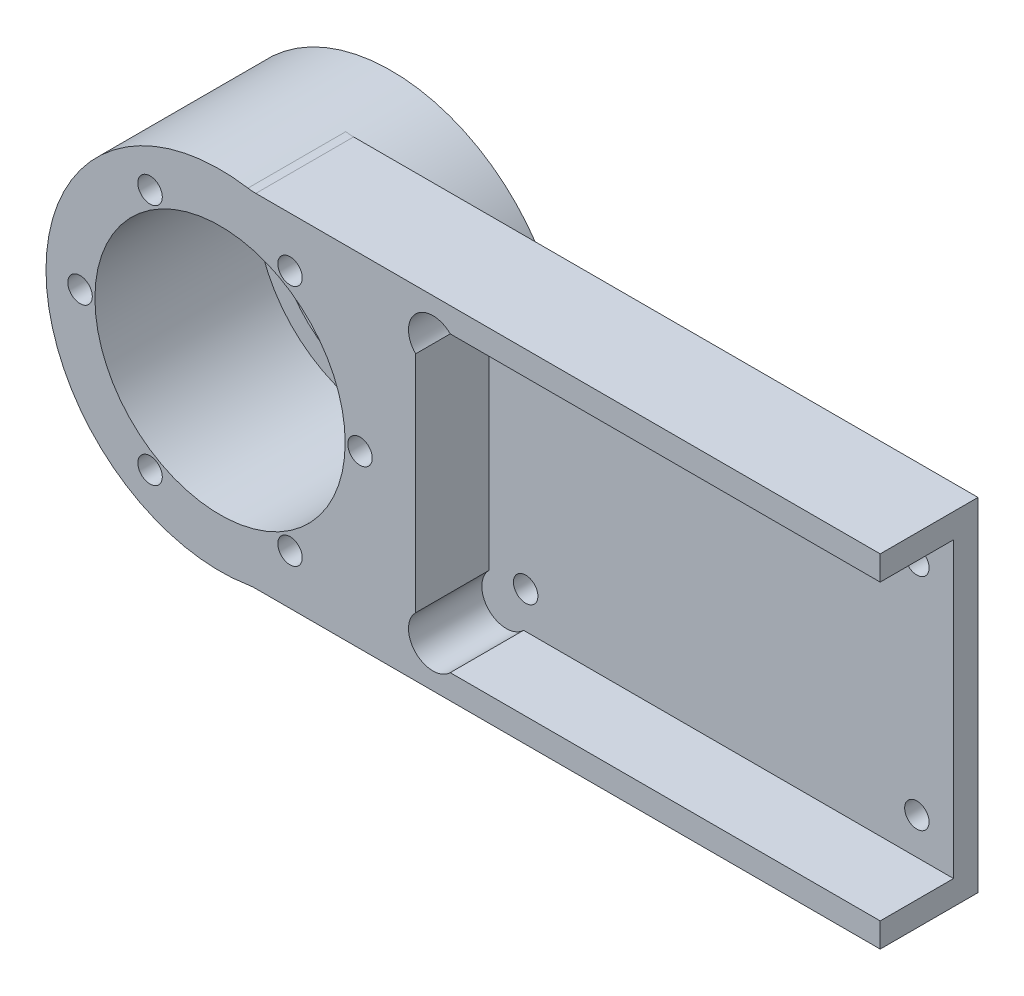
ISO-10303-21;
HEADER;
FILE_DESCRIPTION(('STEP AP214'),'2;1');
FILE_NAME('part.step','',(''),(''),'','','');
FILE_SCHEMA(('AUTOMOTIVE_DESIGN { 1 0 10303 214 1 1 1 1 }'));
ENDSEC;
DATA;
#1=APPLICATION_CONTEXT('core data for automotive mechanical design processes');
#2=APPLICATION_PROTOCOL_DEFINITION('international standard','automotive_design',2000,#1);
#3=PRODUCT_CONTEXT('',#1,'mechanical');
#4=PRODUCT('Part','Part','',(#3));
#5=PRODUCT_RELATED_PRODUCT_CATEGORY('part','',(#4));
#6=PRODUCT_DEFINITION_FORMATION('','',#4);
#7=PRODUCT_DEFINITION_CONTEXT('part definition',#1,'design');
#8=PRODUCT_DEFINITION('design','',#6,#7);
#9=PRODUCT_DEFINITION_SHAPE('','',#8);
#10=(LENGTH_UNIT() NAMED_UNIT(*) SI_UNIT(.MILLI.,.METRE.));
#11=(NAMED_UNIT(*) PLANE_ANGLE_UNIT() SI_UNIT($,.RADIAN.));
#12=(NAMED_UNIT(*) SI_UNIT($,.STERADIAN.) SOLID_ANGLE_UNIT());
#13=UNCERTAINTY_MEASURE_WITH_UNIT(LENGTH_MEASURE(1.E-05),#10,'distance_accuracy_value','');
#14=(GEOMETRIC_REPRESENTATION_CONTEXT(3) GLOBAL_UNCERTAINTY_ASSIGNED_CONTEXT((#13)) GLOBAL_UNIT_ASSIGNED_CONTEXT((#10,
#11,#12)) REPRESENTATION_CONTEXT('',''));
#15=CARTESIAN_POINT('',(0.,0.,0.));
#16=DIRECTION('',(0.,0.,1.));
#17=DIRECTION('',(1.,0.,0.));
#18=AXIS2_PLACEMENT_3D('',#15,#16,#17);
#19=CARTESIAN_POINT('',(0.,0.,6.35));
#20=DIRECTION('',(0.,0.,-1.));
#21=DIRECTION('',(-1.,0.,0.));
#22=AXIS2_PLACEMENT_3D('',#19,#20,#21);
#23=CYLINDRICAL_SURFACE('',#22,32.5);
#24=CARTESIAN_POINT('',(0.,0.,25.4));
#25=DIRECTION('',(0.,0.,1.));
#26=DIRECTION('',(1.,0.,0.));
#27=AXIS2_PLACEMENT_3D('',#24,#25,#26);
#28=CIRCLE('',#27,32.5);
#29=CARTESIAN_POINT('',(32.5,0.,25.4));
#30=VERTEX_POINT('',#29);
#31=EDGE_CURVE('E297',#30,#30,#28,.T.);
#32=ORIENTED_EDGE('',*,*,#31,.T.);
#33=EDGE_LOOP('',(#32));
#34=FACE_BOUND('',#33,.T.);
#35=CARTESIAN_POINT('',(0.,0.,-16.51));
#36=DIRECTION('',(0.,0.,-1.));
#37=DIRECTION('',(-1.,0.,0.));
#38=AXIS2_PLACEMENT_3D('',#35,#36,#37);
#39=CIRCLE('',#38,32.5);
#40=CARTESIAN_POINT('',(-32.5,0.,-16.51));
#41=VERTEX_POINT('',#40);
#42=EDGE_CURVE('E170',#41,#41,#39,.T.);
#43=ORIENTED_EDGE('',*,*,#42,.T.);
#44=EDGE_LOOP('',(#43));
#45=FACE_BOUND('',#44,.T.);
#46=ADVANCED_FACE('F72',(#34,#45),#23,.F.);
#47=CARTESIAN_POINT('',(0.,0.,0.));
#48=DIRECTION('',(0.,0.,1.));
#49=DIRECTION('',(1.,0.,0.));
#50=AXIS2_PLACEMENT_3D('',#47,#48,#49);
#51=PLANE('',#50);
#52=CARTESIAN_POINT('',(60.325,28.575,0.));
#53=DIRECTION('',(0.,0.,1.));
#54=DIRECTION('',(1.,0.,0.));
#55=AXIS2_PLACEMENT_3D('',#52,#53,#54);
#56=CIRCLE('',#55,3.175);
#57=CARTESIAN_POINT('',(63.5,28.575,0.));
#58=VERTEX_POINT('',#57);
#59=EDGE_CURVE('E270',#58,#58,#56,.T.);
#60=ORIENTED_EDGE('',*,*,#59,.T.);
#61=EDGE_LOOP('',(#60));
#62=FACE_BOUND('',#61,.T.);
#63=CARTESIAN_POINT('',(161.925,28.575,0.));
#64=DIRECTION('',(0.,0.,1.));
#65=DIRECTION('',(1.,0.,0.));
#66=AXIS2_PLACEMENT_3D('',#63,#64,#65);
#67=CIRCLE('',#66,3.175);
#68=CARTESIAN_POINT('',(165.1,28.575,0.));
#69=VERTEX_POINT('',#68);
#70=EDGE_CURVE('E266',#69,#69,#67,.T.);
#71=ORIENTED_EDGE('',*,*,#70,.T.);
#72=EDGE_LOOP('',(#71));
#73=FACE_BOUND('',#72,.T.);
#74=CARTESIAN_POINT('',(161.925,-28.575,0.));
#75=DIRECTION('',(0.,0.,1.));
#76=DIRECTION('',(1.,0.,0.));
#77=AXIS2_PLACEMENT_3D('',#74,#75,#76);
#78=CIRCLE('',#77,3.175);
#79=CARTESIAN_POINT('',(165.1,-28.575,0.));
#80=VERTEX_POINT('',#79);
#81=EDGE_CURVE('E271',#80,#80,#78,.T.);
#82=ORIENTED_EDGE('',*,*,#81,.T.);
#83=EDGE_LOOP('',(#82));
#84=FACE_BOUND('',#83,.T.);
#85=CARTESIAN_POINT('',(60.325,-28.575,0.));
#86=DIRECTION('',(0.,0.,1.));
#87=DIRECTION('',(1.,0.,0.));
#88=AXIS2_PLACEMENT_3D('',#85,#86,#87);
#89=CIRCLE('',#88,3.175);
#90=CARTESIAN_POINT('',(63.5,-28.575,0.));
#91=VERTEX_POINT('',#90);
#92=EDGE_CURVE('E265',#91,#91,#89,.T.);
#93=ORIENTED_EDGE('',*,*,#92,.T.);
#94=EDGE_LOOP('',(#93));
#95=FACE_BOUND('',#94,.T.);
#96=CARTESIAN_POINT('',(0.,0.,0.));
#97=DIRECTION('',(0.,0.,-1.));
#98=DIRECTION('',(-1.,0.,0.));
#99=AXIS2_PLACEMENT_3D('',#96,#97,#98);
#100=CIRCLE('',#99,45.2);
#101=CARTESIAN_POINT('',(7.25159956563402,44.6145077720207,0.));
#102=VERTEX_POINT('',#101);
#103=CARTESIAN_POINT('',(7.25159956563402,-44.6145077720207,0.));
#104=VERTEX_POINT('',#103);
#105=EDGE_CURVE('E161',#102,#104,#100,.T.);
#106=ORIENTED_EDGE('',*,*,#105,.F.);
#107=CARTESIAN_POINT('',(9.28910652323473,57.15,0.));
#108=DIRECTION('',(0.,0.,1.));
#109=DIRECTION('',(1.,0.,0.));
#110=AXIS2_PLACEMENT_3D('',#107,#108,#109);
#111=CIRCLE('',#110,12.7);
#112=CARTESIAN_POINT('',(9.28910652323473,44.45,0.));
#113=VERTEX_POINT('',#112);
#114=EDGE_CURVE('E82',#102,#113,#111,.T.);
#115=ORIENTED_EDGE('',*,*,#114,.T.);
#116=DIRECTION('',(1.,0.,0.));
#117=VECTOR('',#116,1.);
#118=CARTESIAN_POINT('',(0.,44.45,0.));
#119=LINE('',#118,#117);
#120=CARTESIAN_POINT('',(171.45,44.45,0.));
#121=VERTEX_POINT('',#120);
#122=EDGE_CURVE('E358',#113,#121,#119,.T.);
#123=ORIENTED_EDGE('',*,*,#122,.T.);
#124=DIRECTION('',(0.,1.,0.));
#125=VECTOR('',#124,1.);
#126=CARTESIAN_POINT('',(171.45,7.4940054162198E-13,0.));
#127=LINE('',#126,#125);
#128=CARTESIAN_POINT('',(171.45,-44.45,0.));
#129=VERTEX_POINT('',#128);
#130=EDGE_CURVE('E348',#129,#121,#127,.T.);
#131=ORIENTED_EDGE('',*,*,#130,.F.);
#132=DIRECTION('',(1.,0.,0.));
#133=VECTOR('',#132,1.);
#134=CARTESIAN_POINT('',(0.,-44.45,0.));
#135=LINE('',#134,#133);
#136=CARTESIAN_POINT('',(9.28910652323473,-44.45,0.));
#137=VERTEX_POINT('',#136);
#138=EDGE_CURVE('E354',#137,#129,#135,.T.);
#139=ORIENTED_EDGE('',*,*,#138,.F.);
#140=CARTESIAN_POINT('',(9.28910652323473,-57.15,0.));
#141=DIRECTION('',(0.,0.,1.));
#142=DIRECTION('',(1.,0.,0.));
#143=AXIS2_PLACEMENT_3D('',#140,#141,#142);
#144=CIRCLE('',#143,12.7);
#145=EDGE_CURVE('E164',#137,#104,#144,.T.);
#146=ORIENTED_EDGE('',*,*,#145,.T.);
#147=EDGE_LOOP('',(#106,#115,#123,#131,#139,#146));
#148=FACE_BOUND('',#147,.T.);
#149=ADVANCED_FACE('F162',(#62,#73,#84,#95,#148),#51,.F.);
#150=CARTESIAN_POINT('',(171.45,7.4940054162198E-13,6.35));
#151=DIRECTION('',(-1.,0.,0.));
#152=DIRECTION('',(0.,-1.,0.));
#153=AXIS2_PLACEMENT_3D('',#150,#151,#152);
#154=PLANE('',#153);
#155=ORIENTED_EDGE('',*,*,#130,.T.);
#156=DIRECTION('',(0.,0.,-1.));
#157=VECTOR('',#156,1.);
#158=CARTESIAN_POINT('',(171.45,44.45,6.35));
#159=LINE('',#158,#157);
#160=CARTESIAN_POINT('',(171.45,44.45,25.4));
#161=VERTEX_POINT('',#160);
#162=EDGE_CURVE('E366',#161,#121,#159,.T.);
#163=ORIENTED_EDGE('',*,*,#162,.F.);
#164=DIRECTION('',(0.,1.,0.));
#165=VECTOR('',#164,1.);
#166=CARTESIAN_POINT('',(171.45,-7.4940054162198E-13,25.4));
#167=LINE('',#166,#165);
#168=CARTESIAN_POINT('',(171.45,38.1,25.4));
#169=VERTEX_POINT('',#168);
#170=EDGE_CURVE('E327',#169,#161,#167,.T.);
#171=ORIENTED_EDGE('',*,*,#170,.F.);
#172=DIRECTION('',(0.,0.,-1.));
#173=VECTOR('',#172,1.);
#174=CARTESIAN_POINT('',(171.45,38.1,25.4));
#175=LINE('',#174,#173);
#176=CARTESIAN_POINT('',(171.45,38.1,6.35));
#177=VERTEX_POINT('',#176);
#178=EDGE_CURVE('E331',#169,#177,#175,.T.);
#179=ORIENTED_EDGE('',*,*,#178,.T.);
#180=DIRECTION('',(0.,1.,0.));
#181=VECTOR('',#180,1.);
#182=CARTESIAN_POINT('',(171.45,7.4940054162198E-13,6.35));
#183=LINE('',#182,#181);
#184=CARTESIAN_POINT('',(171.45,-38.1,6.35));
#185=VERTEX_POINT('',#184);
#186=EDGE_CURVE('E349',#185,#177,#183,.T.);
#187=ORIENTED_EDGE('',*,*,#186,.F.);
#188=DIRECTION('',(0.,0.,-1.));
#189=VECTOR('',#188,1.);
#190=CARTESIAN_POINT('',(171.45,-38.1,25.4));
#191=LINE('',#190,#189);
#192=CARTESIAN_POINT('',(171.45,-38.1,25.4));
#193=VERTEX_POINT('',#192);
#194=EDGE_CURVE('E344',#193,#185,#191,.T.);
#195=ORIENTED_EDGE('',*,*,#194,.F.);
#196=DIRECTION('',(0.,-1.,0.));
#197=VECTOR('',#196,1.);
#198=CARTESIAN_POINT('',(171.45,7.4940054162198E-13,25.4));
#199=LINE('',#198,#197);
#200=CARTESIAN_POINT('',(171.45,-44.45,25.4));
#201=VERTEX_POINT('',#200);
#202=EDGE_CURVE('E312',#193,#201,#199,.T.);
#203=ORIENTED_EDGE('',*,*,#202,.T.);
#204=DIRECTION('',(0.,0.,-1.));
#205=VECTOR('',#204,1.);
#206=CARTESIAN_POINT('',(171.45,-44.45,6.35));
#207=LINE('',#206,#205);
#208=EDGE_CURVE('E353',#201,#129,#207,.T.);
#209=ORIENTED_EDGE('',*,*,#208,.T.);
#210=EDGE_LOOP('',(#155,#163,#171,#179,#187,#195,#203,#209));
#211=FACE_BOUND('',#210,.T.);
#212=ADVANCED_FACE('F405',(#211),#154,.F.);
#213=CARTESIAN_POINT('',(0.,44.45,6.35));
#214=DIRECTION('',(0.,1.,0.));
#215=DIRECTION('',(0.,0.,1.));
#216=AXIS2_PLACEMENT_3D('',#213,#214,#215);
#217=PLANE('',#216);
#218=ORIENTED_EDGE('',*,*,#122,.F.);
#219=DIRECTION('',(0.,0.,-1.));
#220=VECTOR('',#219,1.);
#221=CARTESIAN_POINT('',(9.28910652323473,44.45,6.35));
#222=LINE('',#221,#220);
#223=CARTESIAN_POINT('',(9.28910652323473,44.45,25.4));
#224=VERTEX_POINT('',#223);
#225=EDGE_CURVE('E90',#113,#224,#222,.F.);
#226=ORIENTED_EDGE('',*,*,#225,.T.);
#227=DIRECTION('',(-1.,0.,0.));
#228=VECTOR('',#227,1.);
#229=CARTESIAN_POINT('',(0.,44.45,25.4));
#230=LINE('',#229,#228);
#231=EDGE_CURVE('E302',#161,#224,#230,.T.);
#232=ORIENTED_EDGE('',*,*,#231,.F.);
#233=ORIENTED_EDGE('',*,*,#162,.T.);
#234=EDGE_LOOP('',(#218,#226,#232,#233));
#235=FACE_BOUND('',#234,.T.);
#236=ADVANCED_FACE('F407',(#235),#217,.T.);
#237=CARTESIAN_POINT('',(0.,0.,6.35));
#238=DIRECTION('',(0.,0.,-1.));
#239=DIRECTION('',(-1.,0.,0.));
#240=AXIS2_PLACEMENT_3D('',#237,#238,#239);
#241=CYLINDRICAL_SURFACE('',#240,45.2);
#242=DIRECTION('',(0.,0.,-1.));
#243=VECTOR('',#242,1.);
#244=CARTESIAN_POINT('',(7.25159956563402,44.6145077720207,6.35));
#245=LINE('',#244,#243);
#246=CARTESIAN_POINT('',(7.25159956563402,44.6145077720207,25.4));
#247=VERTEX_POINT('',#246);
#248=EDGE_CURVE('E175',#247,#102,#245,.T.);
#249=ORIENTED_EDGE('',*,*,#248,.T.);
#250=ORIENTED_EDGE('',*,*,#105,.T.);
#251=DIRECTION('',(0.,0.,-1.));
#252=VECTOR('',#251,1.);
#253=CARTESIAN_POINT('',(7.25159956563402,-44.6145077720207,6.35));
#254=LINE('',#253,#252);
#255=CARTESIAN_POINT('',(7.25159956563402,-44.6145077720207,25.4));
#256=VERTEX_POINT('',#255);
#257=EDGE_CURVE('E185',#104,#256,#254,.F.);
#258=ORIENTED_EDGE('',*,*,#257,.T.);
#259=CARTESIAN_POINT('',(0.,0.,25.4));
#260=DIRECTION('',(0.,0.,1.));
#261=DIRECTION('',(1.,0.,0.));
#262=AXIS2_PLACEMENT_3D('',#259,#260,#261);
#263=CIRCLE('',#262,45.2);
#264=EDGE_CURVE('E183',#247,#256,#263,.T.);
#265=ORIENTED_EDGE('',*,*,#264,.F.);
#266=EDGE_LOOP('',(#249,#250,#258,#265));
#267=FACE_BOUND('',#266,.T.);
#268=CARTESIAN_POINT('',(0.,0.,-19.05));
#269=DIRECTION('',(0.,0.,-1.));
#270=DIRECTION('',(-1.,0.,0.));
#271=AXIS2_PLACEMENT_3D('',#268,#269,#270);
#272=CIRCLE('',#271,45.2);
#273=CARTESIAN_POINT('',(-45.2,0.,-19.05));
#274=VERTEX_POINT('',#273);
#275=EDGE_CURVE('E169',#274,#274,#272,.T.);
#276=ORIENTED_EDGE('',*,*,#275,.F.);
#277=EDGE_LOOP('',(#276));
#278=FACE_BOUND('',#277,.T.);
#279=ADVANCED_FACE('F180',(#267,#278),#241,.T.);
#280=CARTESIAN_POINT('',(0.,-44.45,6.35));
#281=DIRECTION('',(0.,1.,0.));
#282=DIRECTION('',(0.,0.,1.));
#283=AXIS2_PLACEMENT_3D('',#280,#281,#282);
#284=PLANE('',#283);
#285=DIRECTION('',(-1.,0.,0.));
#286=VECTOR('',#285,1.);
#287=CARTESIAN_POINT('',(0.,-44.45,25.4));
#288=LINE('',#287,#286);
#289=CARTESIAN_POINT('',(9.28910652323473,-44.45,25.4));
#290=VERTEX_POINT('',#289);
#291=EDGE_CURVE('E308',#201,#290,#288,.T.);
#292=ORIENTED_EDGE('',*,*,#291,.T.);
#293=DIRECTION('',(0.,0.,1.));
#294=VECTOR('',#293,1.);
#295=CARTESIAN_POINT('',(9.28910652323473,-44.45,0.));
#296=LINE('',#295,#294);
#297=EDGE_CURVE('E186',#290,#137,#296,.F.);
#298=ORIENTED_EDGE('',*,*,#297,.T.);
#299=ORIENTED_EDGE('',*,*,#138,.T.);
#300=ORIENTED_EDGE('',*,*,#208,.F.);
#301=EDGE_LOOP('',(#292,#298,#299,#300));
#302=FACE_BOUND('',#301,.T.);
#303=ADVANCED_FACE('F414',(#302),#284,.F.);
#304=CARTESIAN_POINT('',(0.,0.,6.35));
#305=DIRECTION('',(0.,0.,1.));
#306=DIRECTION('',(1.,0.,0.));
#307=AXIS2_PLACEMENT_3D('',#304,#305,#306);
#308=PLANE('',#307);
#309=CARTESIAN_POINT('',(60.325,28.575,6.35));
#310=DIRECTION('',(0.,0.,1.));
#311=DIRECTION('',(1.,0.,0.));
#312=AXIS2_PLACEMENT_3D('',#309,#310,#311);
#313=CIRCLE('',#312,3.175);
#314=CARTESIAN_POINT('',(63.5,28.575,6.35));
#315=VERTEX_POINT('',#314);
#316=EDGE_CURVE('E281',#315,#315,#313,.T.);
#317=ORIENTED_EDGE('',*,*,#316,.F.);
#318=EDGE_LOOP('',(#317));
#319=FACE_BOUND('',#318,.T.);
#320=DIRECTION('',(0.,1.,0.));
#321=VECTOR('',#320,1.);
#322=CARTESIAN_POINT('',(50.8,0.,6.35));
#323=LINE('',#322,#321);
#324=CARTESIAN_POINT('',(50.8,-29.1197438789308,6.35));
#325=VERTEX_POINT('',#324);
#326=CARTESIAN_POINT('',(50.8,29.1197438789308,6.35));
#327=VERTEX_POINT('',#326);
#328=EDGE_CURVE('E335',#325,#327,#323,.T.);
#329=ORIENTED_EDGE('',*,*,#328,.F.);
#330=CARTESIAN_POINT('',(55.2901280605346,-33.6098719394654,6.35));
#331=DIRECTION('',(0.,0.,1.));
#332=DIRECTION('',(1.,0.,0.));
#333=AXIS2_PLACEMENT_3D('',#330,#331,#332);
#334=CIRCLE('',#333,6.35);
#335=CARTESIAN_POINT('',(59.7802561210691,-38.1,6.35));
#336=VERTEX_POINT('',#335);
#337=EDGE_CURVE('E250',#336,#325,#334,.F.);
#338=ORIENTED_EDGE('',*,*,#337,.F.);
#339=DIRECTION('',(-1.,0.,0.));
#340=VECTOR('',#339,1.);
#341=CARTESIAN_POINT('',(0.,-38.1,6.35));
#342=LINE('',#341,#340);
#343=EDGE_CURVE('E301',#185,#336,#342,.T.);
#344=ORIENTED_EDGE('',*,*,#343,.F.);
#345=ORIENTED_EDGE('',*,*,#186,.T.);
#346=DIRECTION('',(1.,0.,0.));
#347=VECTOR('',#346,1.);
#348=CARTESIAN_POINT('',(0.,38.1,6.35));
#349=LINE('',#348,#347);
#350=CARTESIAN_POINT('',(59.7802561210691,38.1,6.35));
#351=VERTEX_POINT('',#350);
#352=EDGE_CURVE('E305',#351,#177,#349,.T.);
#353=ORIENTED_EDGE('',*,*,#352,.F.);
#354=CARTESIAN_POINT('',(55.2901280605346,33.6098719394654,6.35));
#355=DIRECTION('',(0.,0.,1.));
#356=DIRECTION('',(1.,0.,0.));
#357=AXIS2_PLACEMENT_3D('',#354,#355,#356);
#358=CIRCLE('',#357,6.35);
#359=EDGE_CURVE('E249',#327,#351,#358,.F.);
#360=ORIENTED_EDGE('',*,*,#359,.F.);
#361=EDGE_LOOP('',(#329,#338,#344,#345,#353,#360));
#362=FACE_BOUND('',#361,.T.);
#363=CARTESIAN_POINT('',(60.325,-28.575,6.35));
#364=DIRECTION('',(0.,0.,1.));
#365=DIRECTION('',(1.,0.,0.));
#366=AXIS2_PLACEMENT_3D('',#363,#364,#365);
#367=CIRCLE('',#366,3.175);
#368=CARTESIAN_POINT('',(63.5,-28.575,6.35));
#369=VERTEX_POINT('',#368);
#370=EDGE_CURVE('E293',#369,#369,#367,.T.);
#371=ORIENTED_EDGE('',*,*,#370,.F.);
#372=EDGE_LOOP('',(#371));
#373=FACE_BOUND('',#372,.T.);
#374=CARTESIAN_POINT('',(161.925,-28.575,6.35));
#375=DIRECTION('',(0.,0.,1.));
#376=DIRECTION('',(1.,0.,0.));
#377=AXIS2_PLACEMENT_3D('',#374,#375,#376);
#378=CIRCLE('',#377,3.175);
#379=CARTESIAN_POINT('',(165.1,-28.575,6.35));
#380=VERTEX_POINT('',#379);
#381=EDGE_CURVE('E289',#380,#380,#378,.T.);
#382=ORIENTED_EDGE('',*,*,#381,.F.);
#383=EDGE_LOOP('',(#382));
#384=FACE_BOUND('',#383,.T.);
#385=CARTESIAN_POINT('',(161.925,28.575,6.35));
#386=DIRECTION('',(0.,0.,1.));
#387=DIRECTION('',(1.,0.,0.));
#388=AXIS2_PLACEMENT_3D('',#385,#386,#387);
#389=CIRCLE('',#388,3.175);
#390=CARTESIAN_POINT('',(165.1,28.575,6.35));
#391=VERTEX_POINT('',#390);
#392=EDGE_CURVE('E285',#391,#391,#389,.T.);
#393=ORIENTED_EDGE('',*,*,#392,.F.);
#394=EDGE_LOOP('',(#393));
#395=FACE_BOUND('',#394,.T.);
#396=ADVANCED_FACE('F384',(#319,#362,#373,#384,#395),#308,.T.);
#397=CARTESIAN_POINT('',(0.,0.,25.4));
#398=DIRECTION('',(0.,0.,1.));
#399=DIRECTION('',(1.,0.,0.));
#400=AXIS2_PLACEMENT_3D('',#397,#398,#399);
#401=PLANE('',#400);
#402=CARTESIAN_POINT('',(-36.35,0.,25.4));
#403=DIRECTION('',(0.,0.,-1.));
#404=DIRECTION('',(-1.,0.,0.));
#405=AXIS2_PLACEMENT_3D('',#402,#403,#404);
#406=CIRCLE('',#405,3.175);
#407=CARTESIAN_POINT('',(-39.525,0.,25.4));
#408=VERTEX_POINT('',#407);
#409=EDGE_CURVE('E207',#408,#408,#406,.T.);
#410=ORIENTED_EDGE('',*,*,#409,.T.);
#411=EDGE_LOOP('',(#410));
#412=FACE_BOUND('',#411,.T.);
#413=CARTESIAN_POINT('',(-18.175,31.4800234275644,25.4));
#414=DIRECTION('',(0.,0.,-1.));
#415=DIRECTION('',(-1.,0.,0.));
#416=AXIS2_PLACEMENT_3D('',#413,#414,#415);
#417=CIRCLE('',#416,3.17500000000001);
#418=CARTESIAN_POINT('',(-21.35,31.4800234275644,25.4));
#419=VERTEX_POINT('',#418);
#420=EDGE_CURVE('E509',#419,#419,#417,.T.);
#421=ORIENTED_EDGE('',*,*,#420,.T.);
#422=EDGE_LOOP('',(#421));
#423=FACE_BOUND('',#422,.T.);
#424=CARTESIAN_POINT('',(18.175,31.4800234275643,25.4));
#425=DIRECTION('',(0.,0.,-1.));
#426=DIRECTION('',(-1.,0.,0.));
#427=AXIS2_PLACEMENT_3D('',#424,#425,#426);
#428=CIRCLE('',#427,3.175);
#429=CARTESIAN_POINT('',(15.,31.4800234275643,25.4));
#430=VERTEX_POINT('',#429);
#431=EDGE_CURVE('E512',#430,#430,#428,.T.);
#432=ORIENTED_EDGE('',*,*,#431,.T.);
#433=EDGE_LOOP('',(#432));
#434=FACE_BOUND('',#433,.T.);
#435=CARTESIAN_POINT('',(36.35,0.,25.4));
#436=DIRECTION('',(0.,0.,-1.));
#437=DIRECTION('',(-1.,0.,0.));
#438=AXIS2_PLACEMENT_3D('',#435,#436,#437);
#439=CIRCLE('',#438,3.175);
#440=CARTESIAN_POINT('',(33.175,0.,25.4));
#441=VERTEX_POINT('',#440);
#442=EDGE_CURVE('E517',#441,#441,#439,.T.);
#443=ORIENTED_EDGE('',*,*,#442,.T.);
#444=EDGE_LOOP('',(#443));
#445=FACE_BOUND('',#444,.T.);
#446=CARTESIAN_POINT('',(18.175,-31.4800234275643,25.4));
#447=DIRECTION('',(0.,0.,-1.));
#448=DIRECTION('',(-1.,0.,0.));
#449=AXIS2_PLACEMENT_3D('',#446,#447,#448);
#450=CIRCLE('',#449,3.175);
#451=CARTESIAN_POINT('',(15.,-31.4800234275643,25.4));
#452=VERTEX_POINT('',#451);
#453=EDGE_CURVE('E506',#452,#452,#450,.T.);
#454=ORIENTED_EDGE('',*,*,#453,.T.);
#455=EDGE_LOOP('',(#454));
#456=FACE_BOUND('',#455,.T.);
#457=CARTESIAN_POINT('',(-18.175,-31.4800234275643,25.4));
#458=DIRECTION('',(0.,0.,-1.));
#459=DIRECTION('',(-1.,0.,0.));
#460=AXIS2_PLACEMENT_3D('',#457,#458,#459);
#461=CIRCLE('',#460,3.17499999999999);
#462=CARTESIAN_POINT('',(-21.35,-31.4800234275643,25.4));
#463=VERTEX_POINT('',#462);
#464=EDGE_CURVE('E502',#463,#463,#461,.T.);
#465=ORIENTED_EDGE('',*,*,#464,.T.);
#466=EDGE_LOOP('',(#465));
#467=FACE_BOUND('',#466,.T.);
#468=CARTESIAN_POINT('',(55.2901280605346,33.6098719394654,25.4));
#469=DIRECTION('',(0.,0.,1.));
#470=DIRECTION('',(1.,0.,0.));
#471=AXIS2_PLACEMENT_3D('',#468,#469,#470);
#472=CIRCLE('',#471,6.35);
#473=CARTESIAN_POINT('',(59.7802561210691,38.1,25.4));
#474=VERTEX_POINT('',#473);
#475=CARTESIAN_POINT('',(50.8,29.1197438789308,25.4));
#476=VERTEX_POINT('',#475);
#477=EDGE_CURVE('E246',#474,#476,#472,.T.);
#478=ORIENTED_EDGE('',*,*,#477,.F.);
#479=DIRECTION('',(1.,0.,0.));
#480=VECTOR('',#479,1.);
#481=CARTESIAN_POINT('',(0.,38.1,25.4));
#482=LINE('',#481,#480);
#483=EDGE_CURVE('E324',#474,#169,#482,.T.);
#484=ORIENTED_EDGE('',*,*,#483,.T.);
#485=ORIENTED_EDGE('',*,*,#170,.T.);
#486=ORIENTED_EDGE('',*,*,#231,.T.);
#487=CARTESIAN_POINT('',(9.28910652323473,57.15,25.4));
#488=DIRECTION('',(0.,0.,1.));
#489=DIRECTION('',(1.,0.,0.));
#490=AXIS2_PLACEMENT_3D('',#487,#488,#489);
#491=CIRCLE('',#490,12.7);
#492=EDGE_CURVE('E12',#224,#247,#491,.F.);
#493=ORIENTED_EDGE('',*,*,#492,.T.);
#494=ORIENTED_EDGE('',*,*,#264,.T.);
#495=CARTESIAN_POINT('',(9.28910652323473,-57.15,25.4));
#496=DIRECTION('',(0.,0.,1.));
#497=DIRECTION('',(1.,0.,0.));
#498=AXIS2_PLACEMENT_3D('',#495,#496,#497);
#499=CIRCLE('',#498,12.7);
#500=EDGE_CURVE('E177',#256,#290,#499,.F.);
#501=ORIENTED_EDGE('',*,*,#500,.T.);
#502=ORIENTED_EDGE('',*,*,#291,.F.);
#503=ORIENTED_EDGE('',*,*,#202,.F.);
#504=DIRECTION('',(-1.,0.,0.));
#505=VECTOR('',#504,1.);
#506=CARTESIAN_POINT('',(0.,-38.1,25.4));
#507=LINE('',#506,#505);
#508=CARTESIAN_POINT('',(59.7802561210691,-38.1,25.4));
#509=VERTEX_POINT('',#508);
#510=EDGE_CURVE('E316',#193,#509,#507,.T.);
#511=ORIENTED_EDGE('',*,*,#510,.T.);
#512=CARTESIAN_POINT('',(55.2901280605346,-33.6098719394654,25.4));
#513=DIRECTION('',(0.,0.,1.));
#514=DIRECTION('',(-1.,0.,0.));
#515=AXIS2_PLACEMENT_3D('',#512,#513,#514);
#516=CIRCLE('',#515,6.35);
#517=CARTESIAN_POINT('',(50.8,-29.1197438789308,25.4));
#518=VERTEX_POINT('',#517);
#519=EDGE_CURVE('E244',#518,#509,#516,.T.);
#520=ORIENTED_EDGE('',*,*,#519,.F.);
#521=DIRECTION('',(0.,1.,0.));
#522=VECTOR('',#521,1.);
#523=CARTESIAN_POINT('',(50.8,0.,25.4));
#524=LINE('',#523,#522);
#525=EDGE_CURVE('E320',#518,#476,#524,.T.);
#526=ORIENTED_EDGE('',*,*,#525,.T.);
#527=EDGE_LOOP('',(#478,#484,#485,#486,#493,#494,#501,#502,#503,#511,#520,#526));
#528=FACE_BOUND('',#527,.T.);
#529=ORIENTED_EDGE('',*,*,#31,.F.);
#530=EDGE_LOOP('',(#529));
#531=FACE_BOUND('',#530,.T.);
#532=ADVANCED_FACE('F396',(#412,#423,#434,#445,#456,#467,#528,#531),#401,.T.);
#533=CARTESIAN_POINT('',(0.,-38.1,25.4));
#534=DIRECTION('',(0.,-1.,0.));
#535=DIRECTION('',(0.,0.,-1.));
#536=AXIS2_PLACEMENT_3D('',#533,#534,#535);
#537=PLANE('',#536);
#538=ORIENTED_EDGE('',*,*,#343,.T.);
#539=DIRECTION('',(0.,0.,1.));
#540=VECTOR('',#539,1.);
#541=CARTESIAN_POINT('',(59.7802561210691,-38.1,-11.6105122421383));
#542=LINE('',#541,#540);
#543=EDGE_CURVE('E261',#336,#509,#542,.T.);
#544=ORIENTED_EDGE('',*,*,#543,.T.);
#545=ORIENTED_EDGE('',*,*,#510,.F.);
#546=ORIENTED_EDGE('',*,*,#194,.T.);
#547=EDGE_LOOP('',(#538,#544,#545,#546));
#548=FACE_BOUND('',#547,.T.);
#549=ADVANCED_FACE('F402',(#548),#537,.F.);
#550=CARTESIAN_POINT('',(50.8,0.,25.4));
#551=DIRECTION('',(-1.,0.,0.));
#552=DIRECTION('',(0.,0.,1.));
#553=AXIS2_PLACEMENT_3D('',#550,#551,#552);
#554=PLANE('',#553);
#555=ORIENTED_EDGE('',*,*,#328,.T.);
#556=DIRECTION('',(0.,0.,1.));
#557=VECTOR('',#556,1.);
#558=CARTESIAN_POINT('',(50.8,29.1197438789308,-11.6105122421383));
#559=LINE('',#558,#557);
#560=EDGE_CURVE('E253',#327,#476,#559,.T.);
#561=ORIENTED_EDGE('',*,*,#560,.T.);
#562=ORIENTED_EDGE('',*,*,#525,.F.);
#563=DIRECTION('',(0.,0.,1.));
#564=VECTOR('',#563,1.);
#565=CARTESIAN_POINT('',(50.8,-29.1197438789308,-11.6105122421383));
#566=LINE('',#565,#564);
#567=EDGE_CURVE('E192',#518,#325,#566,.F.);
#568=ORIENTED_EDGE('',*,*,#567,.T.);
#569=EDGE_LOOP('',(#555,#561,#562,#568));
#570=FACE_BOUND('',#569,.T.);
#571=ADVANCED_FACE('F379',(#570),#554,.F.);
#572=CARTESIAN_POINT('',(0.,38.1,25.4));
#573=DIRECTION('',(0.,1.,0.));
#574=DIRECTION('',(0.,0.,1.));
#575=AXIS2_PLACEMENT_3D('',#572,#573,#574);
#576=PLANE('',#575);
#577=ORIENTED_EDGE('',*,*,#483,.F.);
#578=DIRECTION('',(0.,0.,1.));
#579=VECTOR('',#578,1.);
#580=CARTESIAN_POINT('',(59.7802561210691,38.1,-11.6105122421383));
#581=LINE('',#580,#579);
#582=EDGE_CURVE('E370',#474,#351,#581,.F.);
#583=ORIENTED_EDGE('',*,*,#582,.T.);
#584=ORIENTED_EDGE('',*,*,#352,.T.);
#585=ORIENTED_EDGE('',*,*,#178,.F.);
#586=EDGE_LOOP('',(#577,#583,#584,#585));
#587=FACE_BOUND('',#586,.T.);
#588=ADVANCED_FACE('F392',(#587),#576,.F.);
#589=CARTESIAN_POINT('',(60.325,28.575,0.));
#590=DIRECTION('',(0.,0.,1.));
#591=DIRECTION('',(1.,0.,0.));
#592=AXIS2_PLACEMENT_3D('',#589,#590,#591);
#593=CYLINDRICAL_SURFACE('',#592,3.175);
#594=ORIENTED_EDGE('',*,*,#316,.T.);
#595=EDGE_LOOP('',(#594));
#596=FACE_BOUND('',#595,.T.);
#597=ORIENTED_EDGE('',*,*,#59,.F.);
#598=EDGE_LOOP('',(#597));
#599=FACE_BOUND('',#598,.T.);
#600=ADVANCED_FACE('F440',(#596,#599),#593,.F.);
#601=CARTESIAN_POINT('',(161.925,28.575,0.));
#602=DIRECTION('',(0.,0.,1.));
#603=DIRECTION('',(1.,0.,0.));
#604=AXIS2_PLACEMENT_3D('',#601,#602,#603);
#605=CYLINDRICAL_SURFACE('',#604,3.175);
#606=ORIENTED_EDGE('',*,*,#392,.T.);
#607=EDGE_LOOP('',(#606));
#608=FACE_BOUND('',#607,.T.);
#609=ORIENTED_EDGE('',*,*,#70,.F.);
#610=EDGE_LOOP('',(#609));
#611=FACE_BOUND('',#610,.T.);
#612=ADVANCED_FACE('F446',(#608,#611),#605,.F.);
#613=CARTESIAN_POINT('',(161.925,-28.575,0.));
#614=DIRECTION('',(0.,0.,1.));
#615=DIRECTION('',(1.,0.,0.));
#616=AXIS2_PLACEMENT_3D('',#613,#614,#615);
#617=CYLINDRICAL_SURFACE('',#616,3.175);
#618=ORIENTED_EDGE('',*,*,#381,.T.);
#619=EDGE_LOOP('',(#618));
#620=FACE_BOUND('',#619,.T.);
#621=ORIENTED_EDGE('',*,*,#81,.F.);
#622=EDGE_LOOP('',(#621));
#623=FACE_BOUND('',#622,.T.);
#624=ADVANCED_FACE('F451',(#620,#623),#617,.F.);
#625=CARTESIAN_POINT('',(60.325,-28.575,0.));
#626=DIRECTION('',(0.,0.,1.));
#627=DIRECTION('',(1.,0.,0.));
#628=AXIS2_PLACEMENT_3D('',#625,#626,#627);
#629=CYLINDRICAL_SURFACE('',#628,3.175);
#630=ORIENTED_EDGE('',*,*,#370,.T.);
#631=EDGE_LOOP('',(#630));
#632=FACE_BOUND('',#631,.T.);
#633=ORIENTED_EDGE('',*,*,#92,.F.);
#634=EDGE_LOOP('',(#633));
#635=FACE_BOUND('',#634,.T.);
#636=ADVANCED_FACE('F448',(#632,#635),#629,.F.);
#637=CARTESIAN_POINT('',(55.2901280605346,33.6098719394654,-11.6105122421383));
#638=DIRECTION('',(0.,0.,1.));
#639=DIRECTION('',(1.,0.,0.));
#640=AXIS2_PLACEMENT_3D('',#637,#638,#639);
#641=CYLINDRICAL_SURFACE('',#640,6.35);
#642=ORIENTED_EDGE('',*,*,#359,.T.);
#643=ORIENTED_EDGE('',*,*,#582,.F.);
#644=ORIENTED_EDGE('',*,*,#477,.T.);
#645=ORIENTED_EDGE('',*,*,#560,.F.);
#646=EDGE_LOOP('',(#642,#643,#644,#645));
#647=FACE_BOUND('',#646,.T.);
#648=ADVANCED_FACE('F389',(#647),#641,.F.);
#649=CARTESIAN_POINT('',(55.2901280605346,-33.6098719394654,-11.6105122421383));
#650=DIRECTION('',(0.,0.,1.));
#651=DIRECTION('',(1.,0.,0.));
#652=AXIS2_PLACEMENT_3D('',#649,#650,#651);
#653=CYLINDRICAL_SURFACE('',#652,6.35);
#654=ORIENTED_EDGE('',*,*,#337,.T.);
#655=ORIENTED_EDGE('',*,*,#567,.F.);
#656=ORIENTED_EDGE('',*,*,#519,.T.);
#657=ORIENTED_EDGE('',*,*,#543,.F.);
#658=EDGE_LOOP('',(#654,#655,#656,#657));
#659=FACE_BOUND('',#658,.T.);
#660=ADVANCED_FACE('F400',(#659),#653,.F.);
#661=CARTESIAN_POINT('',(9.28910652323473,-57.15,6.35));
#662=DIRECTION('',(0.,0.,-1.));
#663=DIRECTION('',(-1.,0.,0.));
#664=AXIS2_PLACEMENT_3D('',#661,#662,#663);
#665=CYLINDRICAL_SURFACE('',#664,12.7);
#666=ORIENTED_EDGE('',*,*,#500,.F.);
#667=ORIENTED_EDGE('',*,*,#257,.F.);
#668=ORIENTED_EDGE('',*,*,#145,.F.);
#669=ORIENTED_EDGE('',*,*,#297,.F.);
#670=EDGE_LOOP('',(#666,#667,#668,#669));
#671=FACE_BOUND('',#670,.T.);
#672=ADVANCED_FACE('F412',(#671),#665,.F.);
#673=CARTESIAN_POINT('',(9.28910652323473,57.15,6.35));
#674=DIRECTION('',(0.,0.,-1.));
#675=DIRECTION('',(-1.,0.,0.));
#676=AXIS2_PLACEMENT_3D('',#673,#674,#675);
#677=CYLINDRICAL_SURFACE('',#676,12.7);
#678=ORIENTED_EDGE('',*,*,#492,.F.);
#679=ORIENTED_EDGE('',*,*,#225,.F.);
#680=ORIENTED_EDGE('',*,*,#114,.F.);
#681=ORIENTED_EDGE('',*,*,#248,.F.);
#682=EDGE_LOOP('',(#678,#679,#680,#681));
#683=FACE_BOUND('',#682,.T.);
#684=ADVANCED_FACE('F74',(#683),#677,.F.);
#685=CARTESIAN_POINT('',(0.,0.,-19.05));
#686=DIRECTION('',(0.,0.,-1.));
#687=DIRECTION('',(-1.,0.,0.));
#688=AXIS2_PLACEMENT_3D('',#685,#686,#687);
#689=PLANE('',#688);
#690=CARTESIAN_POINT('',(-36.35,0.,-19.05));
#691=DIRECTION('',(0.,0.,-1.));
#692=DIRECTION('',(-1.,0.,0.));
#693=AXIS2_PLACEMENT_3D('',#690,#691,#692);
#694=CIRCLE('',#693,3.175);
#695=CARTESIAN_POINT('',(-39.525,0.,-19.05));
#696=VERTEX_POINT('',#695);
#697=EDGE_CURVE('E76',#696,#696,#694,.T.);
#698=ORIENTED_EDGE('',*,*,#697,.F.);
#699=EDGE_LOOP('',(#698));
#700=FACE_BOUND('',#699,.T.);
#701=CARTESIAN_POINT('',(-18.175,31.4800234275644,-19.05));
#702=DIRECTION('',(0.,0.,-1.));
#703=DIRECTION('',(-1.,0.,0.));
#704=AXIS2_PLACEMENT_3D('',#701,#702,#703);
#705=CIRCLE('',#704,3.17500000000001);
#706=CARTESIAN_POINT('',(-21.35,31.4800234275644,-19.05));
#707=VERTEX_POINT('',#706);
#708=EDGE_CURVE('E218',#707,#707,#705,.T.);
#709=ORIENTED_EDGE('',*,*,#708,.F.);
#710=EDGE_LOOP('',(#709));
#711=FACE_BOUND('',#710,.T.);
#712=CARTESIAN_POINT('',(18.175,31.4800234275643,-19.05));
#713=DIRECTION('',(0.,0.,-1.));
#714=DIRECTION('',(-1.,0.,0.));
#715=AXIS2_PLACEMENT_3D('',#712,#713,#714);
#716=CIRCLE('',#715,3.175);
#717=CARTESIAN_POINT('',(15.,31.4800234275643,-19.05));
#718=VERTEX_POINT('',#717);
#719=EDGE_CURVE('E215',#718,#718,#716,.T.);
#720=ORIENTED_EDGE('',*,*,#719,.F.);
#721=EDGE_LOOP('',(#720));
#722=FACE_BOUND('',#721,.T.);
#723=CARTESIAN_POINT('',(36.35,0.,-19.05));
#724=DIRECTION('',(0.,0.,-1.));
#725=DIRECTION('',(-1.,0.,0.));
#726=AXIS2_PLACEMENT_3D('',#723,#724,#725);
#727=CIRCLE('',#726,3.175);
#728=CARTESIAN_POINT('',(33.175,0.,-19.05));
#729=VERTEX_POINT('',#728);
#730=EDGE_CURVE('E211',#729,#729,#727,.T.);
#731=ORIENTED_EDGE('',*,*,#730,.F.);
#732=EDGE_LOOP('',(#731));
#733=FACE_BOUND('',#732,.T.);
#734=CARTESIAN_POINT('',(18.175,-31.4800234275643,-19.05));
#735=DIRECTION('',(0.,0.,-1.));
#736=DIRECTION('',(-1.,0.,0.));
#737=AXIS2_PLACEMENT_3D('',#734,#735,#736);
#738=CIRCLE('',#737,3.175);
#739=CARTESIAN_POINT('',(15.,-31.4800234275643,-19.05));
#740=VERTEX_POINT('',#739);
#741=EDGE_CURVE('E206',#740,#740,#738,.T.);
#742=ORIENTED_EDGE('',*,*,#741,.F.);
#743=EDGE_LOOP('',(#742));
#744=FACE_BOUND('',#743,.T.);
#745=CARTESIAN_POINT('',(-18.175,-31.4800234275643,-19.05));
#746=DIRECTION('',(0.,0.,-1.));
#747=DIRECTION('',(-1.,0.,0.));
#748=AXIS2_PLACEMENT_3D('',#745,#746,#747);
#749=CIRCLE('',#748,3.17499999999999);
#750=CARTESIAN_POINT('',(-21.35,-31.4800234275643,-19.05));
#751=VERTEX_POINT('',#750);
#752=EDGE_CURVE('E202',#751,#751,#749,.T.);
#753=ORIENTED_EDGE('',*,*,#752,.F.);
#754=EDGE_LOOP('',(#753));
#755=FACE_BOUND('',#754,.T.);
#756=ORIENTED_EDGE('',*,*,#275,.T.);
#757=EDGE_LOOP('',(#756));
#758=FACE_BOUND('',#757,.T.);
#759=CARTESIAN_POINT('',(0.,0.,-19.05));
#760=DIRECTION('',(0.,0.,-1.));
#761=DIRECTION('',(-1.,0.,0.));
#762=AXIS2_PLACEMENT_3D('',#759,#760,#761);
#763=CIRCLE('',#762,27.5);
#764=CARTESIAN_POINT('',(-27.5,0.,-19.05));
#765=VERTEX_POINT('',#764);
#766=EDGE_CURVE('E225',#765,#765,#763,.T.);
#767=ORIENTED_EDGE('',*,*,#766,.F.);
#768=EDGE_LOOP('',(#767));
#769=FACE_BOUND('',#768,.T.);
#770=ADVANCED_FACE('F463',(#700,#711,#722,#733,#744,#755,#758,#769),#689,.T.);
#771=CARTESIAN_POINT('',(0.,0.,-16.51));
#772=DIRECTION('',(0.,0.,-1.));
#773=DIRECTION('',(-1.,0.,0.));
#774=AXIS2_PLACEMENT_3D('',#771,#772,#773);
#775=PLANE('',#774);
#776=CARTESIAN_POINT('',(0.,0.,-16.51));
#777=DIRECTION('',(0.,0.,-1.));
#778=DIRECTION('',(-1.,0.,0.));
#779=AXIS2_PLACEMENT_3D('',#776,#777,#778);
#780=CIRCLE('',#779,27.5);
#781=CARTESIAN_POINT('',(-27.5,0.,-16.51));
#782=VERTEX_POINT('',#781);
#783=EDGE_CURVE('E230',#782,#782,#780,.T.);
#784=ORIENTED_EDGE('',*,*,#783,.T.);
#785=EDGE_LOOP('',(#784));
#786=FACE_BOUND('',#785,.T.);
#787=ORIENTED_EDGE('',*,*,#42,.F.);
#788=EDGE_LOOP('',(#787));
#789=FACE_BOUND('',#788,.T.);
#790=ADVANCED_FACE('F466',(#786,#789),#775,.F.);
#791=CARTESIAN_POINT('',(0.,0.,-16.51));
#792=DIRECTION('',(0.,0.,-1.));
#793=DIRECTION('',(-1.,0.,0.));
#794=AXIS2_PLACEMENT_3D('',#791,#792,#793);
#795=CYLINDRICAL_SURFACE('',#794,27.5);
#796=ORIENTED_EDGE('',*,*,#783,.F.);
#797=EDGE_LOOP('',(#796));
#798=FACE_BOUND('',#797,.T.);
#799=ORIENTED_EDGE('',*,*,#766,.T.);
#800=EDGE_LOOP('',(#799));
#801=FACE_BOUND('',#800,.T.);
#802=ADVANCED_FACE('F470',(#798,#801),#795,.F.);
#803=CARTESIAN_POINT('',(-18.175,-31.4800234275643,25.4));
#804=DIRECTION('',(0.,0.,-1.));
#805=DIRECTION('',(-1.,0.,0.));
#806=AXIS2_PLACEMENT_3D('',#803,#804,#805);
#807=CYLINDRICAL_SURFACE('',#806,3.17499999999999);
#808=ORIENTED_EDGE('',*,*,#752,.T.);
#809=EDGE_LOOP('',(#808));
#810=FACE_BOUND('',#809,.T.);
#811=ORIENTED_EDGE('',*,*,#464,.F.);
#812=EDGE_LOOP('',(#811));
#813=FACE_BOUND('',#812,.T.);
#814=ADVANCED_FACE('F474',(#810,#813),#807,.F.);
#815=CARTESIAN_POINT('',(18.175,-31.4800234275643,25.4));
#816=DIRECTION('',(0.,0.,-1.));
#817=DIRECTION('',(-1.,0.,0.));
#818=AXIS2_PLACEMENT_3D('',#815,#816,#817);
#819=CYLINDRICAL_SURFACE('',#818,3.175);
#820=ORIENTED_EDGE('',*,*,#741,.T.);
#821=EDGE_LOOP('',(#820));
#822=FACE_BOUND('',#821,.T.);
#823=ORIENTED_EDGE('',*,*,#453,.F.);
#824=EDGE_LOOP('',(#823));
#825=FACE_BOUND('',#824,.T.);
#826=ADVANCED_FACE('F484',(#822,#825),#819,.F.);
#827=CARTESIAN_POINT('',(36.35,0.,25.4));
#828=DIRECTION('',(0.,0.,-1.));
#829=DIRECTION('',(-1.,0.,0.));
#830=AXIS2_PLACEMENT_3D('',#827,#828,#829);
#831=CYLINDRICAL_SURFACE('',#830,3.175);
#832=ORIENTED_EDGE('',*,*,#730,.T.);
#833=EDGE_LOOP('',(#832));
#834=FACE_BOUND('',#833,.T.);
#835=ORIENTED_EDGE('',*,*,#442,.F.);
#836=EDGE_LOOP('',(#835));
#837=FACE_BOUND('',#836,.T.);
#838=ADVANCED_FACE('F480',(#834,#837),#831,.F.);
#839=CARTESIAN_POINT('',(18.175,31.4800234275643,25.4));
#840=DIRECTION('',(0.,0.,-1.));
#841=DIRECTION('',(-1.,0.,0.));
#842=AXIS2_PLACEMENT_3D('',#839,#840,#841);
#843=CYLINDRICAL_SURFACE('',#842,3.175);
#844=ORIENTED_EDGE('',*,*,#719,.T.);
#845=EDGE_LOOP('',(#844));
#846=FACE_BOUND('',#845,.T.);
#847=ORIENTED_EDGE('',*,*,#431,.F.);
#848=EDGE_LOOP('',(#847));
#849=FACE_BOUND('',#848,.T.);
#850=ADVANCED_FACE('F476',(#846,#849),#843,.F.);
#851=CARTESIAN_POINT('',(-18.175,31.4800234275644,25.4));
#852=DIRECTION('',(0.,0.,-1.));
#853=DIRECTION('',(-1.,0.,0.));
#854=AXIS2_PLACEMENT_3D('',#851,#852,#853);
#855=CYLINDRICAL_SURFACE('',#854,3.17500000000001);
#856=ORIENTED_EDGE('',*,*,#708,.T.);
#857=EDGE_LOOP('',(#856));
#858=FACE_BOUND('',#857,.T.);
#859=ORIENTED_EDGE('',*,*,#420,.F.);
#860=EDGE_LOOP('',(#859));
#861=FACE_BOUND('',#860,.T.);
#862=ADVANCED_FACE('F479',(#858,#861),#855,.F.);
#863=CARTESIAN_POINT('',(-36.35,0.,25.4));
#864=DIRECTION('',(0.,0.,-1.));
#865=DIRECTION('',(-1.,0.,0.));
#866=AXIS2_PLACEMENT_3D('',#863,#864,#865);
#867=CYLINDRICAL_SURFACE('',#866,3.175);
#868=ORIENTED_EDGE('',*,*,#697,.T.);
#869=EDGE_LOOP('',(#868));
#870=FACE_BOUND('',#869,.T.);
#871=ORIENTED_EDGE('',*,*,#409,.F.);
#872=EDGE_LOOP('',(#871));
#873=FACE_BOUND('',#872,.T.);
#874=ADVANCED_FACE('F494',(#870,#873),#867,.F.);
#875=CLOSED_SHELL('',(#46,#149,#212,#236,#279,#303,#396,#532,#549,#571,#588,#600,#612,#624,#636,
#648,#660,#672,#684,#770,#790,#802,#814,#826,#838,#850,#862,#874));
#876=MANIFOLD_SOLID_BREP('B2',#875);
#877=ADVANCED_BREP_SHAPE_REPRESENTATION('',(#18,#876),#14);
#878=SHAPE_DEFINITION_REPRESENTATION(#9,#877);
ENDSEC;
END-ISO-10303-21;
